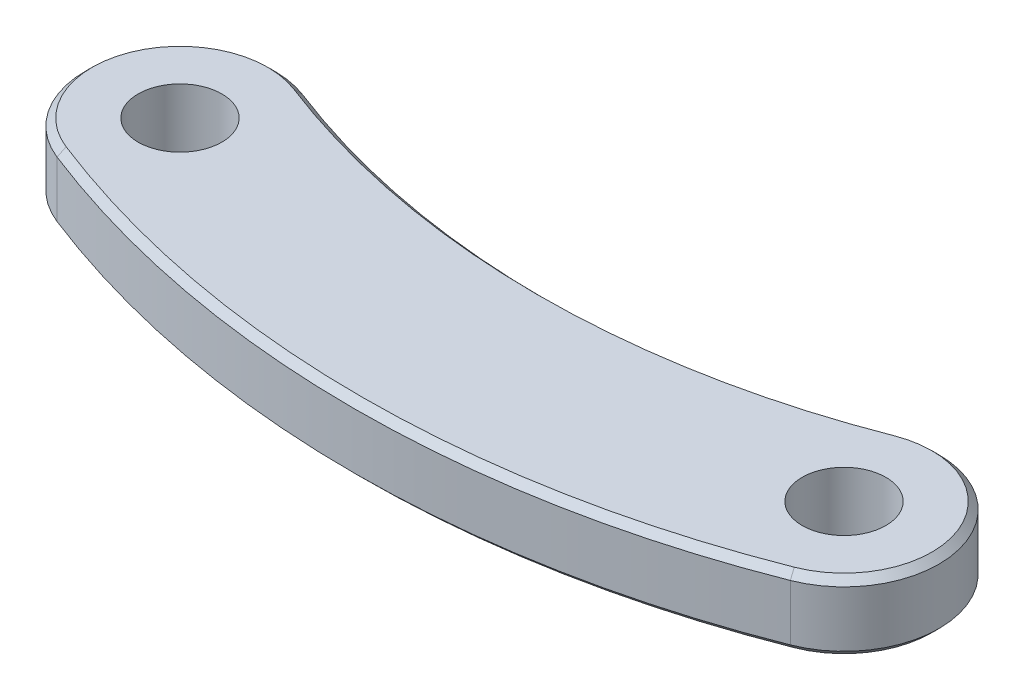
ISO-10303-21;
HEADER;
FILE_DESCRIPTION(('STEP AP214'),'2;1');
FILE_NAME('part.step','',(''),(''),'','','');
FILE_SCHEMA(('AUTOMOTIVE_DESIGN { 1 0 10303 214 1 1 1 1 }'));
ENDSEC;
DATA;
#1=APPLICATION_CONTEXT('core data for automotive mechanical design processes');
#2=APPLICATION_PROTOCOL_DEFINITION('international standard','automotive_design',2000,#1);
#3=PRODUCT_CONTEXT('',#1,'mechanical');
#4=PRODUCT('Part','Part','',(#3));
#5=PRODUCT_RELATED_PRODUCT_CATEGORY('part','',(#4));
#6=PRODUCT_DEFINITION_FORMATION('','',#4);
#7=PRODUCT_DEFINITION_CONTEXT('part definition',#1,'design');
#8=PRODUCT_DEFINITION('design','',#6,#7);
#9=PRODUCT_DEFINITION_SHAPE('','',#8);
#10=(LENGTH_UNIT() NAMED_UNIT(*) SI_UNIT(.MILLI.,.METRE.));
#11=(NAMED_UNIT(*) PLANE_ANGLE_UNIT() SI_UNIT($,.RADIAN.));
#12=(NAMED_UNIT(*) SI_UNIT($,.STERADIAN.) SOLID_ANGLE_UNIT());
#13=UNCERTAINTY_MEASURE_WITH_UNIT(LENGTH_MEASURE(1.E-05),#10,'distance_accuracy_value','');
#14=(GEOMETRIC_REPRESENTATION_CONTEXT(3) GLOBAL_UNCERTAINTY_ASSIGNED_CONTEXT((#13)) GLOBAL_UNIT_ASSIGNED_CONTEXT((#10,
#11,#12)) REPRESENTATION_CONTEXT('',''));
#15=CARTESIAN_POINT('',(0.,0.,0.));
#16=DIRECTION('',(0.,0.,1.));
#17=DIRECTION('',(1.,0.,0.));
#18=AXIS2_PLACEMENT_3D('',#15,#16,#17);
#19=CARTESIAN_POINT('',(35.7,5.,-30.6724632202893));
#20=DIRECTION('',(0.,1.,0.));
#21=DIRECTION('',(0.,0.,1.));
#22=AXIS2_PLACEMENT_3D('',#19,#20,#21);
#23=PLANE('',#22);
#24=CARTESIAN_POINT('',(47.6,5.,0.));
#25=DIRECTION('',(0.,1.,0.));
#26=DIRECTION('',(0.,0.,1.));
#27=AXIS2_PLACEMENT_3D('',#24,#25,#26);
#28=CIRCLE('',#27,6.3);
#29=CARTESIAN_POINT('',(49.8996932515337,5.,5.86527160060386));
#30=VERTEX_POINT('',#29);
#31=CARTESIAN_POINT('',(45.3212765957447,5.,-5.87345040388519));
#32=VERTEX_POINT('',#31);
#33=EDGE_CURVE('E64',#30,#32,#28,.T.);
#34=ORIENTED_EDGE('',*,*,#33,.T.);
#35=CARTESIAN_POINT('',(23.8,5.,-61.3449264405786));
#36=DIRECTION('',(0.,1.,0.));
#37=DIRECTION('',(0.,0.,1.));
#38=AXIS2_PLACEMENT_3D('',#35,#36,#37);
#39=CIRCLE('',#38,59.5);
#40=CARTESIAN_POINT('',(2.27872340425532,5.,-5.87345040388519));
#41=VERTEX_POINT('',#40);
#42=EDGE_CURVE('E11',#32,#41,#39,.F.);
#43=ORIENTED_EDGE('',*,*,#42,.T.);
#44=CARTESIAN_POINT('',(0.,5.,0.));
#45=DIRECTION('',(0.,1.,0.));
#46=DIRECTION('',(0.,0.,1.));
#47=AXIS2_PLACEMENT_3D('',#44,#45,#46);
#48=CIRCLE('',#47,6.3);
#49=CARTESIAN_POINT('',(-2.29969325153375,5.,5.86527160060386));
#50=VERTEX_POINT('',#49);
#51=EDGE_CURVE('E49',#41,#50,#48,.T.);
#52=ORIENTED_EDGE('',*,*,#51,.T.);
#53=CARTESIAN_POINT('',(23.8,5.,-60.7009060887891));
#54=DIRECTION('',(0.,1.,0.));
#55=DIRECTION('',(0.,0.,1.));
#56=AXIS2_PLACEMENT_3D('',#53,#54,#55);
#57=CIRCLE('',#56,71.5);
#58=EDGE_CURVE('E204',#50,#30,#57,.T.);
#59=ORIENTED_EDGE('',*,*,#58,.T.);
#60=EDGE_LOOP('',(#34,#43,#52,#59));
#61=FACE_BOUND('',#60,.T.);
#62=CARTESIAN_POINT('',(0.,5.,0.));
#63=DIRECTION('',(0.,1.,0.));
#64=DIRECTION('',(0.,0.,1.));
#65=AXIS2_PLACEMENT_3D('',#62,#63,#64);
#66=CIRCLE('',#65,3.);
#67=CARTESIAN_POINT('',(0.,5.,3.));
#68=VERTEX_POINT('',#67);
#69=EDGE_CURVE('E175',#68,#68,#66,.T.);
#70=ORIENTED_EDGE('',*,*,#69,.F.);
#71=EDGE_LOOP('',(#70));
#72=FACE_BOUND('',#71,.T.);
#73=CARTESIAN_POINT('',(47.6,5.,0.));
#74=DIRECTION('',(0.,1.,0.));
#75=DIRECTION('',(0.,0.,1.));
#76=AXIS2_PLACEMENT_3D('',#73,#74,#75);
#77=CIRCLE('',#76,3.);
#78=CARTESIAN_POINT('',(47.6,5.,3.));
#79=VERTEX_POINT('',#78);
#80=EDGE_CURVE('E167',#79,#79,#77,.T.);
#81=ORIENTED_EDGE('',*,*,#80,.F.);
#82=EDGE_LOOP('',(#81));
#83=FACE_BOUND('',#82,.T.);
#84=ADVANCED_FACE('F39',(#61,#72,#83),#23,.T.);
#85=CARTESIAN_POINT('',(35.7,0.,-30.6724632202893));
#86=DIRECTION('',(0.,1.,0.));
#87=DIRECTION('',(0.,0.,1.));
#88=AXIS2_PLACEMENT_3D('',#85,#86,#87);
#89=PLANE('',#88);
#90=CARTESIAN_POINT('',(0.,0.,0.));
#91=DIRECTION('',(0.,1.,0.));
#92=DIRECTION('',(0.,0.,1.));
#93=AXIS2_PLACEMENT_3D('',#90,#91,#92);
#94=CIRCLE('',#93,6.3);
#95=CARTESIAN_POINT('',(-2.29969325153375,0.,5.86527160060386));
#96=VERTEX_POINT('',#95);
#97=CARTESIAN_POINT('',(2.27872340425532,0.,-5.87345040388519));
#98=VERTEX_POINT('',#97);
#99=EDGE_CURVE('E191',#96,#98,#94,.F.);
#100=ORIENTED_EDGE('',*,*,#99,.T.);
#101=CARTESIAN_POINT('',(23.8,0.,-61.3449264405786));
#102=DIRECTION('',(0.,1.,0.));
#103=DIRECTION('',(0.,0.,1.));
#104=AXIS2_PLACEMENT_3D('',#101,#102,#103);
#105=CIRCLE('',#104,59.5);
#106=CARTESIAN_POINT('',(45.3212765957447,0.,-5.87345040388519));
#107=VERTEX_POINT('',#106);
#108=EDGE_CURVE('E120',#98,#107,#105,.T.);
#109=ORIENTED_EDGE('',*,*,#108,.T.);
#110=CARTESIAN_POINT('',(47.6,0.,0.));
#111=DIRECTION('',(0.,1.,0.));
#112=DIRECTION('',(0.,0.,1.));
#113=AXIS2_PLACEMENT_3D('',#110,#111,#112);
#114=CIRCLE('',#113,6.3);
#115=CARTESIAN_POINT('',(49.8996932515337,0.,5.86527160060386));
#116=VERTEX_POINT('',#115);
#117=EDGE_CURVE('E189',#107,#116,#114,.F.);
#118=ORIENTED_EDGE('',*,*,#117,.T.);
#119=CARTESIAN_POINT('',(23.8,0.,-60.7009060887891));
#120=DIRECTION('',(0.,1.,0.));
#121=DIRECTION('',(0.,0.,1.));
#122=AXIS2_PLACEMENT_3D('',#119,#120,#121);
#123=CIRCLE('',#122,71.5);
#124=EDGE_CURVE('E187',#116,#96,#123,.F.);
#125=ORIENTED_EDGE('',*,*,#124,.T.);
#126=EDGE_LOOP('',(#100,#109,#118,#125));
#127=FACE_BOUND('',#126,.T.);
#128=CARTESIAN_POINT('',(0.,0.,0.));
#129=DIRECTION('',(0.,1.,0.));
#130=DIRECTION('',(0.,0.,1.));
#131=AXIS2_PLACEMENT_3D('',#128,#129,#130);
#132=CIRCLE('',#131,3.);
#133=CARTESIAN_POINT('',(0.,0.,3.));
#134=VERTEX_POINT('',#133);
#135=EDGE_CURVE('E172',#134,#134,#132,.T.);
#136=ORIENTED_EDGE('',*,*,#135,.T.);
#137=EDGE_LOOP('',(#136));
#138=FACE_BOUND('',#137,.T.);
#139=CARTESIAN_POINT('',(47.6,0.,0.));
#140=DIRECTION('',(0.,1.,0.));
#141=DIRECTION('',(0.,0.,1.));
#142=AXIS2_PLACEMENT_3D('',#139,#140,#141);
#143=CIRCLE('',#142,3.);
#144=CARTESIAN_POINT('',(47.6,0.,3.));
#145=VERTEX_POINT('',#144);
#146=EDGE_CURVE('E161',#145,#145,#143,.T.);
#147=ORIENTED_EDGE('',*,*,#146,.T.);
#148=EDGE_LOOP('',(#147));
#149=FACE_BOUND('',#148,.T.);
#150=ADVANCED_FACE('F234',(#127,#138,#149),#89,.F.);
#151=CARTESIAN_POINT('',(23.8,5.,-61.3449264405786));
#152=DIRECTION('',(0.,-1.,0.));
#153=DIRECTION('',(0.,0.,-1.));
#154=AXIS2_PLACEMENT_3D('',#151,#152,#153);
#155=CYLINDRICAL_SURFACE('',#154,59.);
#156=DIRECTION('',(0.,-1.,0.));
#157=VECTOR('',#156,1.);
#158=CARTESIAN_POINT('',(45.1404255319149,5.,-6.33959726133639));
#159=LINE('',#158,#157);
#160=CARTESIAN_POINT('',(45.1404255319149,4.49999999999999,-6.33959726133639));
#161=VERTEX_POINT('',#160);
#162=CARTESIAN_POINT('',(45.1404255319149,0.5,-6.33959726133639));
#163=VERTEX_POINT('',#162);
#164=EDGE_CURVE('E178',#161,#163,#159,.T.);
#165=ORIENTED_EDGE('',*,*,#164,.T.);
#166=CARTESIAN_POINT('',(23.8,0.5,-61.3449264405786));
#167=DIRECTION('',(0.,1.,0.));
#168=DIRECTION('',(0.,0.,1.));
#169=AXIS2_PLACEMENT_3D('',#166,#167,#168);
#170=CIRCLE('',#169,59.);
#171=CARTESIAN_POINT('',(2.45957446808511,0.5,-6.33959726133639));
#172=VERTEX_POINT('',#171);
#173=EDGE_CURVE('E130',#163,#172,#170,.F.);
#174=ORIENTED_EDGE('',*,*,#173,.T.);
#175=DIRECTION('',(0.,-1.,0.));
#176=VECTOR('',#175,1.);
#177=CARTESIAN_POINT('',(2.45957446808511,5.,-6.33959726133639));
#178=LINE('',#177,#176);
#179=CARTESIAN_POINT('',(2.45957446808511,4.49999999999999,-6.33959726133639));
#180=VERTEX_POINT('',#179);
#181=EDGE_CURVE('E113',#180,#172,#178,.T.);
#182=ORIENTED_EDGE('',*,*,#181,.F.);
#183=CARTESIAN_POINT('',(23.8,4.49999999999999,-61.3449264405786));
#184=DIRECTION('',(0.,1.,0.));
#185=DIRECTION('',(0.,0.,1.));
#186=AXIS2_PLACEMENT_3D('',#183,#184,#185);
#187=CIRCLE('',#186,59.);
#188=EDGE_CURVE('E127',#180,#161,#187,.T.);
#189=ORIENTED_EDGE('',*,*,#188,.T.);
#190=EDGE_LOOP('',(#165,#174,#182,#189));
#191=FACE_BOUND('',#190,.T.);
#192=ADVANCED_FACE('F126',(#191),#155,.F.);
#193=CARTESIAN_POINT('',(0.,5.,0.));
#194=DIRECTION('',(0.,-1.,0.));
#195=DIRECTION('',(0.,0.,-1.));
#196=AXIS2_PLACEMENT_3D('',#193,#194,#195);
#197=CYLINDRICAL_SURFACE('',#196,6.8);
#198=ORIENTED_EDGE('',*,*,#181,.T.);
#199=CARTESIAN_POINT('',(0.,0.5,0.));
#200=DIRECTION('',(0.,1.,0.));
#201=DIRECTION('',(0.,0.,1.));
#202=AXIS2_PLACEMENT_3D('',#199,#200,#201);
#203=CIRCLE('',#202,6.8);
#204=CARTESIAN_POINT('',(-2.48220858895706,0.5,6.33076934668353));
#205=VERTEX_POINT('',#204);
#206=EDGE_CURVE('E119',#172,#205,#203,.T.);
#207=ORIENTED_EDGE('',*,*,#206,.T.);
#208=DIRECTION('',(0.,-1.,0.));
#209=VECTOR('',#208,1.);
#210=CARTESIAN_POINT('',(-2.48220858895706,5.,6.33076934668353));
#211=LINE('',#210,#209);
#212=CARTESIAN_POINT('',(-2.48220858895706,4.49999999999999,6.33076934668353));
#213=VERTEX_POINT('',#212);
#214=EDGE_CURVE('E115',#213,#205,#211,.T.);
#215=ORIENTED_EDGE('',*,*,#214,.F.);
#216=CARTESIAN_POINT('',(0.,4.49999999999999,0.));
#217=DIRECTION('',(0.,1.,0.));
#218=DIRECTION('',(0.,0.,1.));
#219=AXIS2_PLACEMENT_3D('',#216,#217,#218);
#220=CIRCLE('',#219,6.8);
#221=EDGE_CURVE('E110',#213,#180,#220,.F.);
#222=ORIENTED_EDGE('',*,*,#221,.T.);
#223=EDGE_LOOP('',(#198,#207,#215,#222));
#224=FACE_BOUND('',#223,.T.);
#225=ADVANCED_FACE('F112',(#224),#197,.T.);
#226=CARTESIAN_POINT('',(23.8,5.,-60.7009060887891));
#227=DIRECTION('',(0.,-1.,0.));
#228=DIRECTION('',(0.,0.,-1.));
#229=AXIS2_PLACEMENT_3D('',#226,#227,#228);
#230=CYLINDRICAL_SURFACE('',#229,72.);
#231=ORIENTED_EDGE('',*,*,#214,.T.);
#232=CARTESIAN_POINT('',(23.8,0.5,-60.7009060887891));
#233=DIRECTION('',(0.,1.,0.));
#234=DIRECTION('',(0.,0.,1.));
#235=AXIS2_PLACEMENT_3D('',#232,#233,#234);
#236=CIRCLE('',#235,72.);
#237=CARTESIAN_POINT('',(50.0822085889571,0.5,6.33076934668354));
#238=VERTEX_POINT('',#237);
#239=EDGE_CURVE('E202',#205,#238,#236,.T.);
#240=ORIENTED_EDGE('',*,*,#239,.T.);
#241=DIRECTION('',(0.,-1.,0.));
#242=VECTOR('',#241,1.);
#243=CARTESIAN_POINT('',(50.0822085889571,5.,6.33076934668354));
#244=LINE('',#243,#242);
#245=CARTESIAN_POINT('',(50.0822085889571,4.49999999999999,6.33076934668354));
#246=VERTEX_POINT('',#245);
#247=EDGE_CURVE('E182',#246,#238,#244,.T.);
#248=ORIENTED_EDGE('',*,*,#247,.F.);
#249=CARTESIAN_POINT('',(23.8,4.49999999999999,-60.7009060887891));
#250=DIRECTION('',(0.,1.,0.));
#251=DIRECTION('',(0.,0.,1.));
#252=AXIS2_PLACEMENT_3D('',#249,#250,#251);
#253=CIRCLE('',#252,72.);
#254=EDGE_CURVE('E200',#246,#213,#253,.F.);
#255=ORIENTED_EDGE('',*,*,#254,.T.);
#256=EDGE_LOOP('',(#231,#240,#248,#255));
#257=FACE_BOUND('',#256,.T.);
#258=ADVANCED_FACE('F215',(#257),#230,.T.);
#259=CARTESIAN_POINT('',(47.6,5.,0.));
#260=DIRECTION('',(0.,-1.,0.));
#261=DIRECTION('',(0.,0.,-1.));
#262=AXIS2_PLACEMENT_3D('',#259,#260,#261);
#263=CYLINDRICAL_SURFACE('',#262,6.8);
#264=ORIENTED_EDGE('',*,*,#247,.T.);
#265=CARTESIAN_POINT('',(47.6,0.5,0.));
#266=DIRECTION('',(0.,1.,0.));
#267=DIRECTION('',(0.,0.,1.));
#268=AXIS2_PLACEMENT_3D('',#265,#266,#267);
#269=CIRCLE('',#268,6.8);
#270=EDGE_CURVE('E198',#238,#163,#269,.T.);
#271=ORIENTED_EDGE('',*,*,#270,.T.);
#272=ORIENTED_EDGE('',*,*,#164,.F.);
#273=CARTESIAN_POINT('',(47.6,4.49999999999999,0.));
#274=DIRECTION('',(0.,1.,0.));
#275=DIRECTION('',(0.,0.,1.));
#276=AXIS2_PLACEMENT_3D('',#273,#274,#275);
#277=CIRCLE('',#276,6.8);
#278=EDGE_CURVE('E196',#161,#246,#277,.F.);
#279=ORIENTED_EDGE('',*,*,#278,.T.);
#280=EDGE_LOOP('',(#264,#271,#272,#279));
#281=FACE_BOUND('',#280,.T.);
#282=ADVANCED_FACE('F213',(#281),#263,.T.);
#283=CARTESIAN_POINT('',(0.,5.,0.));
#284=DIRECTION('',(0.,-1.,0.));
#285=DIRECTION('',(0.,0.,-1.));
#286=AXIS2_PLACEMENT_3D('',#283,#284,#285);
#287=CYLINDRICAL_SURFACE('',#286,3.);
#288=ORIENTED_EDGE('',*,*,#69,.T.);
#289=EDGE_LOOP('',(#288));
#290=FACE_BOUND('',#289,.T.);
#291=ORIENTED_EDGE('',*,*,#135,.F.);
#292=EDGE_LOOP('',(#291));
#293=FACE_BOUND('',#292,.T.);
#294=ADVANCED_FACE('F242',(#290,#293),#287,.F.);
#295=CARTESIAN_POINT('',(47.6,5.,0.));
#296=DIRECTION('',(0.,-1.,0.));
#297=DIRECTION('',(0.,0.,-1.));
#298=AXIS2_PLACEMENT_3D('',#295,#296,#297);
#299=CYLINDRICAL_SURFACE('',#298,3.);
#300=ORIENTED_EDGE('',*,*,#80,.T.);
#301=EDGE_LOOP('',(#300));
#302=FACE_BOUND('',#301,.T.);
#303=ORIENTED_EDGE('',*,*,#146,.F.);
#304=EDGE_LOOP('',(#303));
#305=FACE_BOUND('',#304,.T.);
#306=ADVANCED_FACE('F269',(#302,#305),#299,.F.);
#307=CARTESIAN_POINT('',(23.8,0.5,-60.7009060887891));
#308=DIRECTION('',(0.,1.,0.));
#309=DIRECTION('',(0.,0.,1.));
#310=AXIS2_PLACEMENT_3D('',#307,#308,#309);
#311=CONICAL_SURFACE('',#310,72.,0.785398163397448);
#312=DIRECTION('',(-0.258115665525152,0.707106781186547,0.658313225759979));
#313=VECTOR('',#312,1.);
#314=CARTESIAN_POINT('',(-2.29969325153375,0.,5.86527160060386));
#315=LINE('',#314,#313);
#316=EDGE_CURVE('E153',#96,#205,#315,.T.);
#317=ORIENTED_EDGE('',*,*,#316,.F.);
#318=ORIENTED_EDGE('',*,*,#124,.F.);
#319=DIRECTION('',(-0.25811566552515,-0.707106781186547,-0.658313225759979));
#320=VECTOR('',#319,1.);
#321=CARTESIAN_POINT('',(50.0822085889571,0.5,6.33076934668354));
#322=LINE('',#321,#320);
#323=EDGE_CURVE('E141',#238,#116,#322,.T.);
#324=ORIENTED_EDGE('',*,*,#323,.F.);
#325=ORIENTED_EDGE('',*,*,#239,.F.);
#326=EDGE_LOOP('',(#317,#318,#324,#325));
#327=FACE_BOUND('',#326,.T.);
#328=ADVANCED_FACE('F218',(#327),#311,.T.);
#329=CARTESIAN_POINT('',(47.6,0.5,0.));
#330=DIRECTION('',(0.,1.,0.));
#331=DIRECTION('',(0.,0.,1.));
#332=AXIS2_PLACEMENT_3D('',#329,#330,#331);
#333=CONICAL_SURFACE('',#332,6.8,0.785398163397448);
#334=ORIENTED_EDGE('',*,*,#323,.T.);
#335=ORIENTED_EDGE('',*,*,#117,.F.);
#336=DIRECTION('',(0.255762027237683,-0.707106781186548,0.659231207865093));
#337=VECTOR('',#336,1.);
#338=CARTESIAN_POINT('',(45.1404255319149,0.5,-6.3395972613364));
#339=LINE('',#338,#337);
#340=EDGE_CURVE('E147',#163,#107,#339,.T.);
#341=ORIENTED_EDGE('',*,*,#340,.F.);
#342=ORIENTED_EDGE('',*,*,#270,.F.);
#343=EDGE_LOOP('',(#334,#335,#341,#342));
#344=FACE_BOUND('',#343,.T.);
#345=ADVANCED_FACE('F221',(#344),#333,.T.);
#346=CARTESIAN_POINT('',(0.,0.5,0.));
#347=DIRECTION('',(0.,1.,0.));
#348=DIRECTION('',(0.,0.,1.));
#349=AXIS2_PLACEMENT_3D('',#346,#347,#348);
#350=CONICAL_SURFACE('',#349,6.8,0.785398163397448);
#351=ORIENTED_EDGE('',*,*,#316,.T.);
#352=ORIENTED_EDGE('',*,*,#206,.F.);
#353=DIRECTION('',(0.255762027237688,0.707106781186548,-0.659231207865092));
#354=VECTOR('',#353,1.);
#355=CARTESIAN_POINT('',(2.27872340425532,0.,-5.87345040388519));
#356=LINE('',#355,#354);
#357=EDGE_CURVE('E144',#98,#172,#356,.T.);
#358=ORIENTED_EDGE('',*,*,#357,.F.);
#359=ORIENTED_EDGE('',*,*,#99,.F.);
#360=EDGE_LOOP('',(#351,#352,#358,#359));
#361=FACE_BOUND('',#360,.T.);
#362=ADVANCED_FACE('F224',(#361),#350,.T.);
#363=CARTESIAN_POINT('',(23.8,0.5,-61.3449264405786));
#364=DIRECTION('',(0.,-1.,0.));
#365=DIRECTION('',(0.,0.,-1.));
#366=AXIS2_PLACEMENT_3D('',#363,#364,#365);
#367=CONICAL_SURFACE('',#366,59.,0.785398163397448);
#368=ORIENTED_EDGE('',*,*,#340,.T.);
#369=ORIENTED_EDGE('',*,*,#108,.F.);
#370=ORIENTED_EDGE('',*,*,#357,.T.);
#371=ORIENTED_EDGE('',*,*,#173,.F.);
#372=EDGE_LOOP('',(#368,#369,#370,#371));
#373=FACE_BOUND('',#372,.T.);
#374=ADVANCED_FACE('F222',(#373),#367,.F.);
#375=CARTESIAN_POINT('',(23.8,5.,-60.7009060887891));
#376=DIRECTION('',(0.,-1.,0.));
#377=DIRECTION('',(0.,0.,-1.));
#378=AXIS2_PLACEMENT_3D('',#375,#376,#377);
#379=CONICAL_SURFACE('',#378,71.5,0.785398163397441);
#380=DIRECTION('',(0.25811566552515,0.707106781186552,-0.658313225759974));
#381=VECTOR('',#380,1.);
#382=CARTESIAN_POINT('',(-2.48220858895706,4.49999999999999,6.33076934668353));
#383=LINE('',#382,#381);
#384=EDGE_CURVE('E138',#213,#50,#383,.T.);
#385=ORIENTED_EDGE('',*,*,#384,.F.);
#386=ORIENTED_EDGE('',*,*,#254,.F.);
#387=DIRECTION('',(0.258115665525148,-0.707106781186552,0.658313225759974));
#388=VECTOR('',#387,1.);
#389=CARTESIAN_POINT('',(49.8996932515337,5.,5.86527160060386));
#390=LINE('',#389,#388);
#391=EDGE_CURVE('E44',#30,#246,#390,.T.);
#392=ORIENTED_EDGE('',*,*,#391,.F.);
#393=ORIENTED_EDGE('',*,*,#58,.F.);
#394=EDGE_LOOP('',(#385,#386,#392,#393));
#395=FACE_BOUND('',#394,.T.);
#396=ADVANCED_FACE('F42',(#395),#379,.T.);
#397=CARTESIAN_POINT('',(47.6,5.,0.));
#398=DIRECTION('',(0.,-1.,0.));
#399=DIRECTION('',(0.,0.,-1.));
#400=AXIS2_PLACEMENT_3D('',#397,#398,#399);
#401=CONICAL_SURFACE('',#400,6.3,0.785398163397441);
#402=ORIENTED_EDGE('',*,*,#391,.T.);
#403=ORIENTED_EDGE('',*,*,#278,.F.);
#404=DIRECTION('',(-0.255762027237682,-0.707106781186553,-0.659231207865089));
#405=VECTOR('',#404,1.);
#406=CARTESIAN_POINT('',(45.3212765957447,5.,-5.87345040388519));
#407=LINE('',#406,#405);
#408=EDGE_CURVE('E133',#32,#161,#407,.T.);
#409=ORIENTED_EDGE('',*,*,#408,.F.);
#410=ORIENTED_EDGE('',*,*,#33,.F.);
#411=EDGE_LOOP('',(#402,#403,#409,#410));
#412=FACE_BOUND('',#411,.T.);
#413=ADVANCED_FACE('F210',(#412),#401,.T.);
#414=CARTESIAN_POINT('',(0.,5.,0.));
#415=DIRECTION('',(0.,-1.,0.));
#416=DIRECTION('',(0.,0.,-1.));
#417=AXIS2_PLACEMENT_3D('',#414,#415,#416);
#418=CONICAL_SURFACE('',#417,6.3,0.785398163397441);
#419=ORIENTED_EDGE('',*,*,#384,.T.);
#420=ORIENTED_EDGE('',*,*,#51,.F.);
#421=DIRECTION('',(-0.255762027237686,0.707106781186553,0.659231207865087));
#422=VECTOR('',#421,1.);
#423=CARTESIAN_POINT('',(2.45957446808511,4.49999999999999,-6.33959726133639));
#424=LINE('',#423,#422);
#425=EDGE_CURVE('E57',#180,#41,#424,.T.);
#426=ORIENTED_EDGE('',*,*,#425,.F.);
#427=ORIENTED_EDGE('',*,*,#221,.F.);
#428=EDGE_LOOP('',(#419,#420,#426,#427));
#429=FACE_BOUND('',#428,.T.);
#430=ADVANCED_FACE('F136',(#429),#418,.T.);
#431=CARTESIAN_POINT('',(23.8,5.,-61.3449264405786));
#432=DIRECTION('',(0.,1.,0.));
#433=DIRECTION('',(0.,0.,1.));
#434=AXIS2_PLACEMENT_3D('',#431,#432,#433);
#435=CONICAL_SURFACE('',#434,59.5,0.785398163397441);
#436=ORIENTED_EDGE('',*,*,#408,.T.);
#437=ORIENTED_EDGE('',*,*,#188,.F.);
#438=ORIENTED_EDGE('',*,*,#425,.T.);
#439=ORIENTED_EDGE('',*,*,#42,.F.);
#440=EDGE_LOOP('',(#436,#437,#438,#439));
#441=FACE_BOUND('',#440,.T.);
#442=ADVANCED_FACE('F132',(#441),#435,.F.);
#443=CLOSED_SHELL('',(#84,#150,#192,#225,#258,#282,#294,#306,#328,#345,#362,#374,#396,#413,#430,#442));
#444=MANIFOLD_SOLID_BREP('B2',#443);
#445=ADVANCED_BREP_SHAPE_REPRESENTATION('',(#18,#444),#14);
#446=SHAPE_DEFINITION_REPRESENTATION(#9,#445);
ENDSEC;
END-ISO-10303-21;
